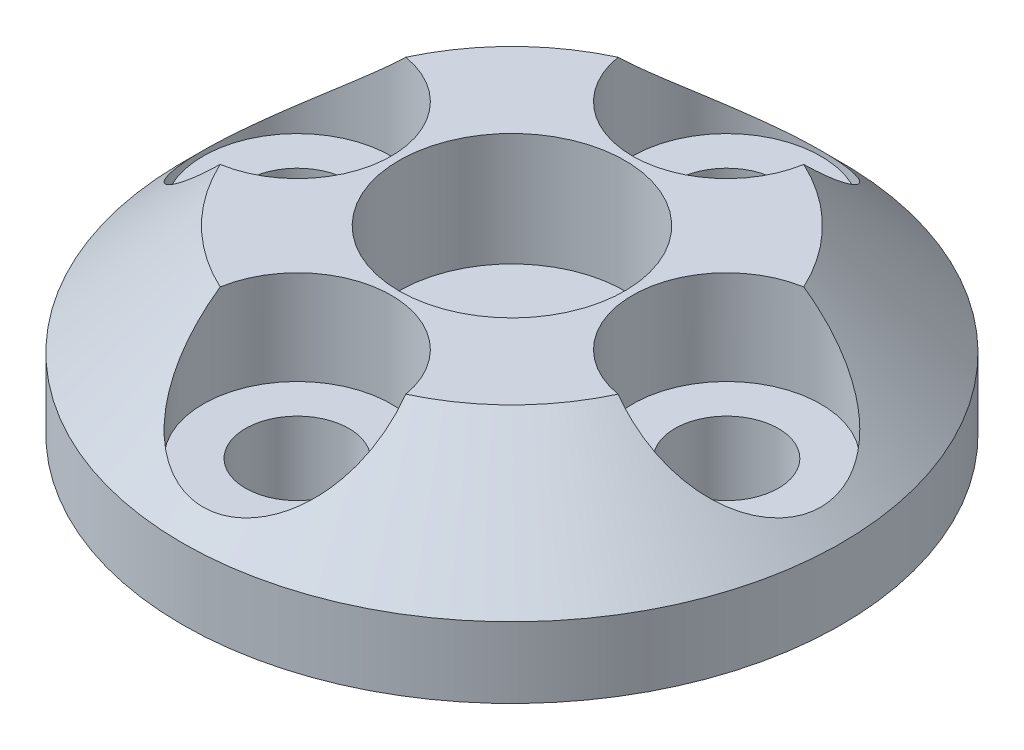
ISO-10303-21;
HEADER;
FILE_DESCRIPTION(('STEP AP214'),'2;1');
FILE_NAME('part.step','',(''),(''),'','','');
FILE_SCHEMA(('AUTOMOTIVE_DESIGN { 1 0 10303 214 1 1 1 1 }'));
ENDSEC;
DATA;
#1=APPLICATION_CONTEXT('core data for automotive mechanical design processes');
#2=APPLICATION_PROTOCOL_DEFINITION('international standard','automotive_design',2000,#1);
#3=PRODUCT_CONTEXT('',#1,'mechanical');
#4=PRODUCT('Part','Part','',(#3));
#5=PRODUCT_RELATED_PRODUCT_CATEGORY('part','',(#4));
#6=PRODUCT_DEFINITION_FORMATION('','',#4);
#7=PRODUCT_DEFINITION_CONTEXT('part definition',#1,'design');
#8=PRODUCT_DEFINITION('design','',#6,#7);
#9=PRODUCT_DEFINITION_SHAPE('','',#8);
#10=(LENGTH_UNIT() NAMED_UNIT(*) SI_UNIT(.MILLI.,.METRE.));
#11=(NAMED_UNIT(*) PLANE_ANGLE_UNIT() SI_UNIT($,.RADIAN.));
#12=(NAMED_UNIT(*) SI_UNIT($,.STERADIAN.) SOLID_ANGLE_UNIT());
#13=UNCERTAINTY_MEASURE_WITH_UNIT(LENGTH_MEASURE(1.E-05),#10,'distance_accuracy_value','');
#14=(GEOMETRIC_REPRESENTATION_CONTEXT(3) GLOBAL_UNCERTAINTY_ASSIGNED_CONTEXT((#13)) GLOBAL_UNIT_ASSIGNED_CONTEXT((#10,
#11,#12)) REPRESENTATION_CONTEXT('',''));
#15=CARTESIAN_POINT('',(0.,0.,0.));
#16=DIRECTION('',(0.,0.,1.));
#17=DIRECTION('',(1.,0.,0.));
#18=AXIS2_PLACEMENT_3D('',#15,#16,#17);
#19=CARTESIAN_POINT('',(0.,4.8,0.));
#20=DIRECTION('',(0.,-1.,0.));
#21=DIRECTION('',(0.,0.,-1.));
#22=AXIS2_PLACEMENT_3D('',#19,#20,#21);
#23=CYLINDRICAL_SURFACE('',#22,8.75);
#24=CARTESIAN_POINT('',(0.,1.87899999999998,0.));
#25=DIRECTION('',(0.,1.,0.));
#26=DIRECTION('',(0.,0.,1.));
#27=AXIS2_PLACEMENT_3D('',#24,#25,#26);
#28=CIRCLE('',#27,8.75);
#29=CARTESIAN_POINT('',(0.,1.87899999999998,8.75));
#30=VERTEX_POINT('',#29);
#31=EDGE_CURVE('E11',#30,#30,#28,.F.);
#32=ORIENTED_EDGE('',*,*,#31,.T.);
#33=EDGE_LOOP('',(#32));
#34=FACE_BOUND('',#33,.T.);
#35=CARTESIAN_POINT('',(0.,0.,0.));
#36=DIRECTION('',(0.,1.,0.));
#37=DIRECTION('',(0.,0.,1.));
#38=AXIS2_PLACEMENT_3D('',#35,#36,#37);
#39=CIRCLE('',#38,8.75);
#40=CARTESIAN_POINT('',(0.,0.,8.75));
#41=VERTEX_POINT('',#40);
#42=EDGE_CURVE('E115',#41,#41,#39,.T.);
#43=ORIENTED_EDGE('',*,*,#42,.T.);
#44=EDGE_LOOP('',(#43));
#45=FACE_BOUND('',#44,.T.);
#46=ADVANCED_FACE('F32',(#34,#45),#23,.T.);
#47=CARTESIAN_POINT('',(0.,4.8,0.));
#48=DIRECTION('',(0.,1.,0.));
#49=DIRECTION('',(0.,0.,1.));
#50=AXIS2_PLACEMENT_3D('',#47,#48,#49);
#51=PLANE('',#50);
#52=CARTESIAN_POINT('',(5.7,4.8,0.));
#53=DIRECTION('',(0.,1.,0.));
#54=DIRECTION('',(0.,0.,1.));
#55=AXIS2_PLACEMENT_3D('',#52,#53,#54);
#56=CIRCLE('',#55,2.5);
#57=CARTESIAN_POINT('',(5.28221412280697,4.8,-2.46484380049082));
#58=VERTEX_POINT('',#57);
#59=CARTESIAN_POINT('',(5.28221412280697,4.8,2.46484380049082));
#60=VERTEX_POINT('',#59);
#61=EDGE_CURVE('E86',#58,#60,#56,.T.);
#62=ORIENTED_EDGE('',*,*,#61,.F.);
#63=CARTESIAN_POINT('',(0.,4.8,0.));
#64=DIRECTION('',(0.,1.,0.));
#65=DIRECTION('',(0.,0.,1.));
#66=AXIS2_PLACEMENT_3D('',#63,#64,#65);
#67=CIRCLE('',#66,5.82899999999995);
#68=CARTESIAN_POINT('',(2.46484380049082,4.8,-5.28221412280697));
#69=VERTEX_POINT('',#68);
#70=EDGE_CURVE('E77',#58,#69,#67,.T.);
#71=ORIENTED_EDGE('',*,*,#70,.T.);
#72=CARTESIAN_POINT('',(0.,4.8,-5.7));
#73=DIRECTION('',(0.,1.,0.));
#74=DIRECTION('',(0.,0.,1.));
#75=AXIS2_PLACEMENT_3D('',#72,#73,#74);
#76=CIRCLE('',#75,2.5);
#77=CARTESIAN_POINT('',(-2.46484380049082,4.8,-5.28221412280697));
#78=VERTEX_POINT('',#77);
#79=EDGE_CURVE('E84',#78,#69,#76,.T.);
#80=ORIENTED_EDGE('',*,*,#79,.F.);
#81=CARTESIAN_POINT('',(0.,4.8,0.));
#82=DIRECTION('',(0.,1.,0.));
#83=DIRECTION('',(0.,0.,1.));
#84=AXIS2_PLACEMENT_3D('',#81,#82,#83);
#85=CIRCLE('',#84,5.82899999999995);
#86=CARTESIAN_POINT('',(-5.28221412280697,4.8,-2.46484380049082));
#87=VERTEX_POINT('',#86);
#88=EDGE_CURVE('E48',#78,#87,#85,.T.);
#89=ORIENTED_EDGE('',*,*,#88,.T.);
#90=CARTESIAN_POINT('',(-5.7,4.8,0.));
#91=DIRECTION('',(0.,1.,0.));
#92=DIRECTION('',(0.,0.,1.));
#93=AXIS2_PLACEMENT_3D('',#90,#91,#92);
#94=CIRCLE('',#93,2.5);
#95=CARTESIAN_POINT('',(-5.28221412280697,4.8,2.46484380049082));
#96=VERTEX_POINT('',#95);
#97=EDGE_CURVE('E93',#96,#87,#94,.T.);
#98=ORIENTED_EDGE('',*,*,#97,.F.);
#99=CARTESIAN_POINT('',(0.,4.8,0.));
#100=DIRECTION('',(0.,1.,0.));
#101=DIRECTION('',(0.,0.,1.));
#102=AXIS2_PLACEMENT_3D('',#99,#100,#101);
#103=CIRCLE('',#102,5.82899999999995);
#104=CARTESIAN_POINT('',(-2.46484380049082,4.8,5.28221412280697));
#105=VERTEX_POINT('',#104);
#106=EDGE_CURVE('E122',#96,#105,#103,.T.);
#107=ORIENTED_EDGE('',*,*,#106,.T.);
#108=CARTESIAN_POINT('',(0.,4.8,5.7));
#109=DIRECTION('',(0.,1.,0.));
#110=DIRECTION('',(0.,0.,1.));
#111=AXIS2_PLACEMENT_3D('',#108,#109,#110);
#112=CIRCLE('',#111,2.5);
#113=CARTESIAN_POINT('',(2.46484380049082,4.8,5.28221412280697));
#114=VERTEX_POINT('',#113);
#115=EDGE_CURVE('E103',#114,#105,#112,.T.);
#116=ORIENTED_EDGE('',*,*,#115,.F.);
#117=CARTESIAN_POINT('',(0.,4.8,0.));
#118=DIRECTION('',(0.,1.,0.));
#119=DIRECTION('',(0.,0.,1.));
#120=AXIS2_PLACEMENT_3D('',#117,#118,#119);
#121=CIRCLE('',#120,5.82899999999995);
#122=EDGE_CURVE('E120',#114,#60,#121,.T.);
#123=ORIENTED_EDGE('',*,*,#122,.T.);
#124=EDGE_LOOP('',(#62,#71,#80,#89,#98,#107,#116,#123));
#125=FACE_BOUND('',#124,.T.);
#126=CARTESIAN_POINT('',(0.,4.8,0.));
#127=DIRECTION('',(0.,1.,0.));
#128=DIRECTION('',(0.,0.,1.));
#129=AXIS2_PLACEMENT_3D('',#126,#127,#128);
#130=CIRCLE('',#129,3.);
#131=CARTESIAN_POINT('',(0.,4.8,3.));
#132=VERTEX_POINT('',#131);
#133=EDGE_CURVE('E110',#132,#132,#130,.T.);
#134=ORIENTED_EDGE('',*,*,#133,.F.);
#135=EDGE_LOOP('',(#134));
#136=FACE_BOUND('',#135,.T.);
#137=ADVANCED_FACE('F82',(#125,#136),#51,.T.);
#138=CARTESIAN_POINT('',(0.,0.,0.));
#139=DIRECTION('',(0.,1.,0.));
#140=DIRECTION('',(0.,0.,1.));
#141=AXIS2_PLACEMENT_3D('',#138,#139,#140);
#142=PLANE('',#141);
#143=CARTESIAN_POINT('',(0.,0.,-5.7));
#144=DIRECTION('',(0.,1.,0.));
#145=DIRECTION('',(0.,0.,1.));
#146=AXIS2_PLACEMENT_3D('',#143,#144,#145);
#147=CIRCLE('',#146,1.375);
#148=CARTESIAN_POINT('',(0.,0.,-4.325));
#149=VERTEX_POINT('',#148);
#150=EDGE_CURVE('E239',#149,#149,#147,.T.);
#151=ORIENTED_EDGE('',*,*,#150,.T.);
#152=EDGE_LOOP('',(#151));
#153=FACE_BOUND('',#152,.T.);
#154=CARTESIAN_POINT('',(5.7,0.,0.));
#155=DIRECTION('',(0.,1.,0.));
#156=DIRECTION('',(0.,0.,1.));
#157=AXIS2_PLACEMENT_3D('',#154,#155,#156);
#158=CIRCLE('',#157,1.375);
#159=CARTESIAN_POINT('',(5.7,0.,1.375));
#160=VERTEX_POINT('',#159);
#161=EDGE_CURVE('E236',#160,#160,#158,.T.);
#162=ORIENTED_EDGE('',*,*,#161,.T.);
#163=EDGE_LOOP('',(#162));
#164=FACE_BOUND('',#163,.T.);
#165=CARTESIAN_POINT('',(0.,0.,5.7));
#166=DIRECTION('',(0.,1.,0.));
#167=DIRECTION('',(0.,0.,1.));
#168=AXIS2_PLACEMENT_3D('',#165,#166,#167);
#169=CIRCLE('',#168,1.375);
#170=CARTESIAN_POINT('',(0.,0.,7.075));
#171=VERTEX_POINT('',#170);
#172=EDGE_CURVE('E231',#171,#171,#169,.T.);
#173=ORIENTED_EDGE('',*,*,#172,.T.);
#174=EDGE_LOOP('',(#173));
#175=FACE_BOUND('',#174,.T.);
#176=CARTESIAN_POINT('',(-5.7,0.,0.));
#177=DIRECTION('',(0.,1.,0.));
#178=DIRECTION('',(0.,0.,1.));
#179=AXIS2_PLACEMENT_3D('',#176,#177,#178);
#180=CIRCLE('',#179,1.375);
#181=CARTESIAN_POINT('',(-5.7,0.,1.375));
#182=VERTEX_POINT('',#181);
#183=EDGE_CURVE('E106',#182,#182,#180,.T.);
#184=ORIENTED_EDGE('',*,*,#183,.T.);
#185=EDGE_LOOP('',(#184));
#186=FACE_BOUND('',#185,.T.);
#187=ORIENTED_EDGE('',*,*,#42,.F.);
#188=EDGE_LOOP('',(#187));
#189=FACE_BOUND('',#188,.T.);
#190=ADVANCED_FACE('F183',(#153,#164,#175,#186,#189),#142,.F.);
#191=CARTESIAN_POINT('',(0.,1.8,0.));
#192=DIRECTION('',(0.,1.,0.));
#193=DIRECTION('',(0.,0.,1.));
#194=AXIS2_PLACEMENT_3D('',#191,#192,#193);
#195=CYLINDRICAL_SURFACE('',#194,3.);
#196=CARTESIAN_POINT('',(0.,1.8,0.));
#197=DIRECTION('',(0.,1.,0.));
#198=DIRECTION('',(0.,0.,1.));
#199=AXIS2_PLACEMENT_3D('',#196,#197,#198);
#200=CIRCLE('',#199,3.);
#201=CARTESIAN_POINT('',(0.,1.8,3.));
#202=VERTEX_POINT('',#201);
#203=EDGE_CURVE('E112',#202,#202,#200,.T.);
#204=ORIENTED_EDGE('',*,*,#203,.F.);
#205=EDGE_LOOP('',(#204));
#206=FACE_BOUND('',#205,.T.);
#207=ORIENTED_EDGE('',*,*,#133,.T.);
#208=EDGE_LOOP('',(#207));
#209=FACE_BOUND('',#208,.T.);
#210=ADVANCED_FACE('F179',(#206,#209),#195,.F.);
#211=CARTESIAN_POINT('',(0.,1.8,0.));
#212=DIRECTION('',(0.,1.,0.));
#213=DIRECTION('',(0.,0.,1.));
#214=AXIS2_PLACEMENT_3D('',#211,#212,#213);
#215=PLANE('',#214);
#216=ORIENTED_EDGE('',*,*,#203,.T.);
#217=EDGE_LOOP('',(#216));
#218=FACE_BOUND('',#217,.T.);
#219=ADVANCED_FACE('F175',(#218),#215,.T.);
#220=CARTESIAN_POINT('',(-5.7,2.3,0.));
#221=DIRECTION('',(0.,1.,0.));
#222=DIRECTION('',(0.,0.,1.));
#223=AXIS2_PLACEMENT_3D('',#220,#221,#222);
#224=CYLINDRICAL_SURFACE('',#223,2.5);
#225=CARTESIAN_POINT('',(-5.7,2.3,0.));
#226=DIRECTION('',(0.,1.,0.));
#227=DIRECTION('',(0.,0.,1.));
#228=AXIS2_PLACEMENT_3D('',#225,#226,#227);
#229=CIRCLE('',#228,2.5);
#230=CARTESIAN_POINT('',(-5.7,2.3,2.5));
#231=VERTEX_POINT('',#230);
#232=EDGE_CURVE('E107',#231,#231,#229,.T.);
#233=ORIENTED_EDGE('',*,*,#232,.F.);
#234=EDGE_LOOP('',(#233));
#235=FACE_BOUND('',#234,.T.);
#236=ORIENTED_EDGE('',*,*,#97,.T.);
#237=CARTESIAN_POINT('',(-5.28221412280697,4.8,-2.46484380049082));
#238=CARTESIAN_POINT('',(-5.35685185452661,4.72701175799832,-2.47748464183037));
#239=CARTESIAN_POINT('',(-5.4324437619375,4.65446725948549,-2.48681820358606));
#240=CARTESIAN_POINT('',(-5.585243304919,4.51042457385126,-2.49854405497803));
#241=CARTESIAN_POINT('',(-5.66245203180307,4.4389271526757,-2.50093149338337));
#242=CARTESIAN_POINT('',(-5.89686155100504,4.22552560489395,-2.49714852435835));
#243=CARTESIAN_POINT('',(-6.05591923761437,4.08561519336834,-2.47986859636929));
#244=CARTESIAN_POINT('',(-6.36178920286839,3.82458130082494,-2.41547889582656));
#245=CARTESIAN_POINT('',(-6.50858817243777,3.70284383442358,-2.37080290617975));
#246=CARTESIAN_POINT('',(-6.79743791636666,3.46908520453516,-2.25164936300002));
#247=CARTESIAN_POINT('',(-6.93950037027056,3.35703885570162,-2.17725206490176));
#248=CARTESIAN_POINT('',(-7.18633006950314,3.16633051840269,-2.01450799855736));
#249=CARTESIAN_POINT('',(-7.29298231840593,3.08541098190916,-1.93167609104576));
#250=CARTESIAN_POINT('',(-7.49522235712765,2.93411578133862,-1.74528857441806));
#251=CARTESIAN_POINT('',(-7.59081841471378,2.86373222675978,-1.64174861091044));
#252=CARTESIAN_POINT('',(-7.75216300730045,2.74626235026001,-1.43289140796958));
#253=CARTESIAN_POINT('',(-7.82024071447338,2.69725146100408,-1.33046232178874));
#254=CARTESIAN_POINT('',(-7.94200343174676,2.61022608575618,-1.11306505259367));
#255=CARTESIAN_POINT('',(-7.99569419442898,2.57220720415734,-0.998101907236316));
#256=CARTESIAN_POINT('',(-8.08594254680287,2.50860769345851,-0.757539813516246));
#257=CARTESIAN_POINT('',(-8.12240095105975,2.4830990394564,-0.631884090844494));
#258=CARTESIAN_POINT('',(-8.17528685432261,2.44617529257916,-0.37442311497189));
#259=CARTESIAN_POINT('',(-8.19172464747872,2.43475295679659,-0.242621058307452));
#260=CARTESIAN_POINT('',(-8.20282046725454,2.42703924251311,0.00874406262018123));
#261=CARTESIAN_POINT('',(-8.19953665510753,2.42931803419563,0.12817813387292));
#262=CARTESIAN_POINT('',(-8.1761268796412,2.44560751099777,0.364541250890062));
#263=CARTESIAN_POINT('',(-8.15600420242345,2.45961590708749,0.481470780849437));
#264=CARTESIAN_POINT('',(-8.1007170798256,2.49828453152934,0.706916776975113));
#265=CARTESIAN_POINT('',(-8.06590658256427,2.52269423732603,0.815564379543837));
#266=CARTESIAN_POINT('',(-7.98304535617101,2.58116993933686,1.02488281492334));
#267=CARTESIAN_POINT('',(-7.93499192413041,2.61523790686174,1.12555201391992));
#268=CARTESIAN_POINT('',(-7.8236233420379,2.69483320541779,1.32445672718976));
#269=CARTESIAN_POINT('',(-7.75942536768774,2.74103505855147,1.42192472247276));
#270=CARTESIAN_POINT('',(-7.62075389629209,2.84188640202683,1.60432263090368));
#271=CARTESIAN_POINT('',(-7.54627591744053,2.89653957817588,1.68924704177234));
#272=CARTESIAN_POINT('',(-7.37786886035834,3.02162427734208,1.85767759840974));
#273=CARTESIAN_POINT('',(-7.28269481985839,3.09319346194983,1.93908930084336));
#274=CARTESIAN_POINT('',(-7.08543661936823,3.24390184576992,2.08461493710995));
#275=CARTESIAN_POINT('',(-6.9833480298641,3.32304591117767,2.14871764903451));
#276=CARTESIAN_POINT('',(-6.72690489439696,3.52540275079093,2.28588432305007));
#277=CARTESIAN_POINT('',(-6.57017408245346,3.65209597539162,2.34942946883527));
#278=CARTESIAN_POINT('',(-6.25445646893793,3.91497356644743,2.44331798116976));
#279=CARTESIAN_POINT('',(-6.09546522118186,4.05117959691058,2.47358274855852));
#280=CARTESIAN_POINT('',(-5.82600335120247,4.28973502612568,2.49935868983763));
#281=CARTESIAN_POINT('',(-5.71476745854277,4.39051560745032,2.50237716303838));
#282=CARTESIAN_POINT('',(-5.49576917077739,4.59392603683369,2.49403198971323));
#283=CARTESIAN_POINT('',(-5.3879899662017,4.69654119979713,2.48275434609112));
#284=CARTESIAN_POINT('',(-5.28221412280697,4.8,2.46484380049082));
#285=B_SPLINE_CURVE_WITH_KNOTS('',3,(#237,#238,#239,#240,#241,#242,#243,#244,#245,#246,#247,
#248,#249,#250,#251,#252,#253,#254,#255,#256,#257,#258,#259,#260,#261,#262,#263,#264,#265,#266,
#267,#268,#269,#270,#271,#272,#273,#274,#275,#276,#277,#278,#279,#280,#281,#282,#283,#284),
.UNSPECIFIED.,.F.,.F.,(4,2,2,2,2,2,2,2,2,2,2,2,2,2,2,2,2,2,2,2,2,2,2,4),(0.,0.31534497175401,
0.630910130280914,1.26591913307851,1.85135987279008,2.43523033804621,2.90571205902747,
3.37583964956256,3.7713800599024,4.16676207765206,4.56439291403321,4.96181921110816,
5.31854310048601,5.67519739148945,6.02370800398157,6.37228980091359,6.74738530227407,
7.12264485479727,7.55378598779882,7.9852059742906,8.61574083578251,9.24776167116849,
9.69744843323235,10.1444427530248),.UNSPECIFIED.);
#286=EDGE_CURVE('E54',#87,#96,#285,.T.);
#287=ORIENTED_EDGE('',*,*,#286,.T.);
#288=EDGE_LOOP('',(#236,#287));
#289=FACE_BOUND('',#288,.T.);
#290=ADVANCED_FACE('F170',(#235,#289),#224,.F.);
#291=CARTESIAN_POINT('',(-5.7,2.3,0.));
#292=DIRECTION('',(0.,1.,0.));
#293=DIRECTION('',(0.,0.,1.));
#294=AXIS2_PLACEMENT_3D('',#291,#292,#293);
#295=PLANE('',#294);
#296=CARTESIAN_POINT('',(-5.7,2.3,0.));
#297=DIRECTION('',(0.,1.,0.));
#298=DIRECTION('',(0.,0.,1.));
#299=AXIS2_PLACEMENT_3D('',#296,#297,#298);
#300=CIRCLE('',#299,1.375);
#301=CARTESIAN_POINT('',(-5.7,2.3,1.375));
#302=VERTEX_POINT('',#301);
#303=EDGE_CURVE('E227',#302,#302,#300,.T.);
#304=ORIENTED_EDGE('',*,*,#303,.F.);
#305=EDGE_LOOP('',(#304));
#306=FACE_BOUND('',#305,.T.);
#307=ORIENTED_EDGE('',*,*,#232,.T.);
#308=EDGE_LOOP('',(#307));
#309=FACE_BOUND('',#308,.T.);
#310=ADVANCED_FACE('F167',(#306,#309),#295,.T.);
#311=CARTESIAN_POINT('',(0.,2.3,5.7));
#312=DIRECTION('',(0.,1.,0.));
#313=DIRECTION('',(0.,0.,1.));
#314=AXIS2_PLACEMENT_3D('',#311,#312,#313);
#315=CYLINDRICAL_SURFACE('',#314,2.5);
#316=CARTESIAN_POINT('',(0.,2.3,5.7));
#317=DIRECTION('',(0.,1.,0.));
#318=DIRECTION('',(0.,0.,1.));
#319=AXIS2_PLACEMENT_3D('',#316,#317,#318);
#320=CIRCLE('',#319,2.5);
#321=CARTESIAN_POINT('',(0.,2.3,8.2));
#322=VERTEX_POINT('',#321);
#323=EDGE_CURVE('E100',#322,#322,#320,.T.);
#324=ORIENTED_EDGE('',*,*,#323,.F.);
#325=EDGE_LOOP('',(#324));
#326=FACE_BOUND('',#325,.T.);
#327=ORIENTED_EDGE('',*,*,#115,.T.);
#328=CARTESIAN_POINT('',(-2.46484380049082,4.8,5.28221412280697));
#329=CARTESIAN_POINT('',(-2.47748464183037,4.72701175799832,5.35685185452661));
#330=CARTESIAN_POINT('',(-2.48681820358606,4.65446725948549,5.4324437619375));
#331=CARTESIAN_POINT('',(-2.49854405497803,4.51042457385126,5.585243304919));
#332=CARTESIAN_POINT('',(-2.50093149338337,4.4389271526757,5.66245203180307));
#333=CARTESIAN_POINT('',(-2.49714852435835,4.22552560489395,5.89686155100504));
#334=CARTESIAN_POINT('',(-2.47986859636929,4.08561519336834,6.05591923761437));
#335=CARTESIAN_POINT('',(-2.41547889582656,3.82458130082494,6.36178920286839));
#336=CARTESIAN_POINT('',(-2.37080290617975,3.70284383442358,6.50858817243778));
#337=CARTESIAN_POINT('',(-2.25164936300002,3.46908520453516,6.79743791636667));
#338=CARTESIAN_POINT('',(-2.17725206490176,3.35703885570162,6.93950037027056));
#339=CARTESIAN_POINT('',(-2.01450799855736,3.16633051840269,7.18633006950314));
#340=CARTESIAN_POINT('',(-1.93167609104576,3.08541098190916,7.29298231840593));
#341=CARTESIAN_POINT('',(-1.74528857441806,2.93411578133862,7.49522235712765));
#342=CARTESIAN_POINT('',(-1.64174861091044,2.86373222675977,7.59081841471378));
#343=CARTESIAN_POINT('',(-1.43289140796958,2.74626235026001,7.75216300730045));
#344=CARTESIAN_POINT('',(-1.33046232178874,2.69725146100408,7.82024071447338));
#345=CARTESIAN_POINT('',(-1.11306505259367,2.61022608575618,7.94200343174676));
#346=CARTESIAN_POINT('',(-0.998101907236315,2.57220720415734,7.99569419442898));
#347=CARTESIAN_POINT('',(-0.757539813516245,2.50860769345851,8.08594254680287));
#348=CARTESIAN_POINT('',(-0.631884090844493,2.4830990394564,8.12240095105975));
#349=CARTESIAN_POINT('',(-0.374423114971888,2.44617529257916,8.17528685432261));
#350=CARTESIAN_POINT('',(-0.24262105830745,2.43475295679659,8.19172464747872));
#351=CARTESIAN_POINT('',(0.00874406262018338,2.42703924251311,8.20282046725454));
#352=CARTESIAN_POINT('',(0.128178133872922,2.42931803419563,8.19953665510753));
#353=CARTESIAN_POINT('',(0.364541250890064,2.44560751099777,8.1761268796412));
#354=CARTESIAN_POINT('',(0.481470780849439,2.45961590708749,8.15600420242345));
#355=CARTESIAN_POINT('',(0.706916776975116,2.49828453152934,8.1007170798256));
#356=CARTESIAN_POINT('',(0.815564379543839,2.52269423732603,8.06590658256427));
#357=CARTESIAN_POINT('',(1.02488281492334,2.58116993933686,7.98304535617101));
#358=CARTESIAN_POINT('',(1.12555201391992,2.61523790686174,7.93499192413041));
#359=CARTESIAN_POINT('',(1.32445672718976,2.69483320541779,7.8236233420379));
#360=CARTESIAN_POINT('',(1.42192472247276,2.74103505855147,7.75942536768774));
#361=CARTESIAN_POINT('',(1.60432263090368,2.84188640202683,7.62075389629209));
#362=CARTESIAN_POINT('',(1.68924704177234,2.89653957817588,7.54627591744053));
#363=CARTESIAN_POINT('',(1.85767759840974,3.02162427734209,7.37786886035834));
#364=CARTESIAN_POINT('',(1.93908930084336,3.09319346194983,7.28269481985839));
#365=CARTESIAN_POINT('',(2.08461493710995,3.24390184576992,7.08543661936823));
#366=CARTESIAN_POINT('',(2.14871764903451,3.32304591117767,6.9833480298641));
#367=CARTESIAN_POINT('',(2.28588432305007,3.52540275079093,6.72690489439696));
#368=CARTESIAN_POINT('',(2.34942946883527,3.65209597539162,6.57017408245346));
#369=CARTESIAN_POINT('',(2.44331798116977,3.91497356644744,6.25445646893792));
#370=CARTESIAN_POINT('',(2.47358274855852,4.05117959691059,6.09546522118185));
#371=CARTESIAN_POINT('',(2.49935868983763,4.28973502612569,5.82600335120246));
#372=CARTESIAN_POINT('',(2.50237716303839,4.39051560745032,5.71476745854276));
#373=CARTESIAN_POINT('',(2.49403198971323,4.5939260368337,5.49576917077738));
#374=CARTESIAN_POINT('',(2.48275434609112,4.69654119979713,5.3879899662017));
#375=CARTESIAN_POINT('',(2.46484380049082,4.8,5.28221412280697));
#376=B_SPLINE_CURVE_WITH_KNOTS('',3,(#328,#329,#330,#331,#332,#333,#334,#335,#336,#337,#338,
#339,#340,#341,#342,#343,#344,#345,#346,#347,#348,#349,#350,#351,#352,#353,#354,#355,#356,#357,
#358,#359,#360,#361,#362,#363,#364,#365,#366,#367,#368,#369,#370,#371,#372,#373,#374,#375),
.UNSPECIFIED.,.F.,.F.,(4,2,2,2,2,2,2,2,2,2,2,2,2,2,2,2,2,2,2,2,2,2,2,4),(0.,0.31534497175401,
0.630910130280915,1.26591913307851,1.85135987279008,2.43523033804621,2.90571205902747,
3.37583964956256,3.77138005990241,4.16676207765206,4.56439291403321,4.96181921110816,
5.31854310048601,5.67519739148945,6.02370800398158,6.3722898009136,6.74738530227407,
7.12264485479727,7.55378598779883,7.98520597429061,8.61574083578252,9.2477616711685,
9.69744843323236,10.1444427530248),.UNSPECIFIED.);
#377=EDGE_CURVE('E158',#105,#114,#376,.T.);
#378=ORIENTED_EDGE('',*,*,#377,.T.);
#379=EDGE_LOOP('',(#327,#378));
#380=FACE_BOUND('',#379,.T.);
#381=ADVANCED_FACE('F163',(#326,#380),#315,.F.);
#382=CARTESIAN_POINT('',(0.,2.3,5.7));
#383=DIRECTION('',(0.,1.,0.));
#384=DIRECTION('',(0.,0.,1.));
#385=AXIS2_PLACEMENT_3D('',#382,#383,#384);
#386=PLANE('',#385);
#387=CARTESIAN_POINT('',(0.,2.3,5.7));
#388=DIRECTION('',(0.,1.,0.));
#389=DIRECTION('',(0.,0.,1.));
#390=AXIS2_PLACEMENT_3D('',#387,#388,#389);
#391=CIRCLE('',#390,1.375);
#392=CARTESIAN_POINT('',(0.,2.3,7.075));
#393=VERTEX_POINT('',#392);
#394=EDGE_CURVE('E243',#393,#393,#391,.T.);
#395=ORIENTED_EDGE('',*,*,#394,.F.);
#396=EDGE_LOOP('',(#395));
#397=FACE_BOUND('',#396,.T.);
#398=ORIENTED_EDGE('',*,*,#323,.T.);
#399=EDGE_LOOP('',(#398));
#400=FACE_BOUND('',#399,.T.);
#401=ADVANCED_FACE('F151',(#397,#400),#386,.T.);
#402=CARTESIAN_POINT('',(5.7,2.3,0.));
#403=DIRECTION('',(0.,1.,0.));
#404=DIRECTION('',(0.,0.,1.));
#405=AXIS2_PLACEMENT_3D('',#402,#403,#404);
#406=CYLINDRICAL_SURFACE('',#405,2.5);
#407=CARTESIAN_POINT('',(5.7,2.3,0.));
#408=DIRECTION('',(0.,1.,0.));
#409=DIRECTION('',(0.,0.,1.));
#410=AXIS2_PLACEMENT_3D('',#407,#408,#409);
#411=CIRCLE('',#410,2.5);
#412=CARTESIAN_POINT('',(5.7,2.3,2.5));
#413=VERTEX_POINT('',#412);
#414=EDGE_CURVE('E90',#413,#413,#411,.T.);
#415=ORIENTED_EDGE('',*,*,#414,.F.);
#416=EDGE_LOOP('',(#415));
#417=FACE_BOUND('',#416,.T.);
#418=ORIENTED_EDGE('',*,*,#61,.T.);
#419=CARTESIAN_POINT('',(5.28221412280697,4.8,2.46484380049082));
#420=CARTESIAN_POINT('',(5.35685185452661,4.72701175799832,2.47748464183037));
#421=CARTESIAN_POINT('',(5.4324437619375,4.65446725948549,2.48681820358606));
#422=CARTESIAN_POINT('',(5.585243304919,4.51042457385126,2.49854405497803));
#423=CARTESIAN_POINT('',(5.66245203180307,4.4389271526757,2.50093149338337));
#424=CARTESIAN_POINT('',(5.89686155100504,4.22552560489395,2.49714852435835));
#425=CARTESIAN_POINT('',(6.05591923761437,4.08561519336834,2.47986859636929));
#426=CARTESIAN_POINT('',(6.36178920286839,3.82458130082494,2.41547889582656));
#427=CARTESIAN_POINT('',(6.50858817243777,3.70284383442358,2.37080290617975));
#428=CARTESIAN_POINT('',(6.79743791636666,3.46908520453516,2.25164936300002));
#429=CARTESIAN_POINT('',(6.93950037027056,3.35703885570162,2.17725206490176));
#430=CARTESIAN_POINT('',(7.18633006950314,3.16633051840269,2.01450799855736));
#431=CARTESIAN_POINT('',(7.29298231840593,3.08541098190916,1.93167609104576));
#432=CARTESIAN_POINT('',(7.49522235712765,2.93411578133862,1.74528857441806));
#433=CARTESIAN_POINT('',(7.59081841471378,2.86373222675978,1.64174861091044));
#434=CARTESIAN_POINT('',(7.75216300730045,2.74626235026001,1.43289140796958));
#435=CARTESIAN_POINT('',(7.82024071447338,2.69725146100408,1.33046232178874));
#436=CARTESIAN_POINT('',(7.94200343174676,2.61022608575618,1.11306505259367));
#437=CARTESIAN_POINT('',(7.99569419442898,2.57220720415734,0.998101907236316));
#438=CARTESIAN_POINT('',(8.08594254680287,2.50860769345851,0.757539813516246));
#439=CARTESIAN_POINT('',(8.12240095105975,2.4830990394564,0.631884090844494));
#440=CARTESIAN_POINT('',(8.17528685432261,2.44617529257916,0.37442311497189));
#441=CARTESIAN_POINT('',(8.19172464747872,2.43475295679659,0.242621058307452));
#442=CARTESIAN_POINT('',(8.20282046725454,2.42703924251311,-0.00874406262018123));
#443=CARTESIAN_POINT('',(8.19953665510753,2.42931803419563,-0.12817813387292));
#444=CARTESIAN_POINT('',(8.1761268796412,2.44560751099777,-0.364541250890062));
#445=CARTESIAN_POINT('',(8.15600420242345,2.45961590708749,-0.481470780849437));
#446=CARTESIAN_POINT('',(8.1007170798256,2.49828453152934,-0.706916776975113));
#447=CARTESIAN_POINT('',(8.06590658256427,2.52269423732603,-0.815564379543837));
#448=CARTESIAN_POINT('',(7.98304535617101,2.58116993933686,-1.02488281492334));
#449=CARTESIAN_POINT('',(7.93499192413041,2.61523790686174,-1.12555201391992));
#450=CARTESIAN_POINT('',(7.8236233420379,2.69483320541779,-1.32445672718976));
#451=CARTESIAN_POINT('',(7.75942536768774,2.74103505855147,-1.42192472247276));
#452=CARTESIAN_POINT('',(7.62075389629209,2.84188640202683,-1.60432263090368));
#453=CARTESIAN_POINT('',(7.54627591744053,2.89653957817588,-1.68924704177234));
#454=CARTESIAN_POINT('',(7.37786886035834,3.02162427734208,-1.85767759840974));
#455=CARTESIAN_POINT('',(7.28269481985839,3.09319346194983,-1.93908930084336));
#456=CARTESIAN_POINT('',(7.08543661936823,3.24390184576992,-2.08461493710995));
#457=CARTESIAN_POINT('',(6.9833480298641,3.32304591117767,-2.14871764903451));
#458=CARTESIAN_POINT('',(6.72690489439696,3.52540275079093,-2.28588432305007));
#459=CARTESIAN_POINT('',(6.57017408245346,3.65209597539162,-2.34942946883527));
#460=CARTESIAN_POINT('',(6.25445646893793,3.91497356644743,-2.44331798116976));
#461=CARTESIAN_POINT('',(6.09546522118186,4.05117959691058,-2.47358274855852));
#462=CARTESIAN_POINT('',(5.82600335120247,4.28973502612568,-2.49935868983763));
#463=CARTESIAN_POINT('',(5.71476745854277,4.39051560745032,-2.50237716303838));
#464=CARTESIAN_POINT('',(5.49576917077739,4.59392603683369,-2.49403198971323));
#465=CARTESIAN_POINT('',(5.3879899662017,4.69654119979713,-2.48275434609112));
#466=CARTESIAN_POINT('',(5.28221412280697,4.8,-2.46484380049082));
#467=B_SPLINE_CURVE_WITH_KNOTS('',3,(#419,#420,#421,#422,#423,#424,#425,#426,#427,#428,#429,
#430,#431,#432,#433,#434,#435,#436,#437,#438,#439,#440,#441,#442,#443,#444,#445,#446,#447,#448,
#449,#450,#451,#452,#453,#454,#455,#456,#457,#458,#459,#460,#461,#462,#463,#464,#465,#466),
.UNSPECIFIED.,.F.,.F.,(4,2,2,2,2,2,2,2,2,2,2,2,2,2,2,2,2,2,2,2,2,2,2,4),(0.,0.31534497175401,
0.630910130280914,1.26591913307851,1.85135987279008,2.43523033804621,2.90571205902747,
3.37583964956256,3.7713800599024,4.16676207765206,4.56439291403321,4.96181921110816,
5.31854310048601,5.67519739148945,6.02370800398157,6.37228980091359,6.74738530227407,
7.12264485479727,7.55378598779882,7.9852059742906,8.61574083578251,9.24776167116849,
9.69744843323235,10.1444427530248),.UNSPECIFIED.);
#468=EDGE_CURVE('E41',#60,#58,#467,.T.);
#469=ORIENTED_EDGE('',*,*,#468,.T.);
#470=EDGE_LOOP('',(#418,#469));
#471=FACE_BOUND('',#470,.T.);
#472=ADVANCED_FACE('F146',(#417,#471),#406,.F.);
#473=CARTESIAN_POINT('',(5.7,2.3,0.));
#474=DIRECTION('',(0.,1.,0.));
#475=DIRECTION('',(0.,0.,1.));
#476=AXIS2_PLACEMENT_3D('',#473,#474,#475);
#477=PLANE('',#476);
#478=CARTESIAN_POINT('',(5.7,2.3,0.));
#479=DIRECTION('',(0.,1.,0.));
#480=DIRECTION('',(0.,0.,1.));
#481=AXIS2_PLACEMENT_3D('',#478,#479,#480);
#482=CIRCLE('',#481,1.375);
#483=CARTESIAN_POINT('',(5.7,2.3,1.375));
#484=VERTEX_POINT('',#483);
#485=EDGE_CURVE('E245',#484,#484,#482,.T.);
#486=ORIENTED_EDGE('',*,*,#485,.F.);
#487=EDGE_LOOP('',(#486));
#488=FACE_BOUND('',#487,.T.);
#489=ORIENTED_EDGE('',*,*,#414,.T.);
#490=EDGE_LOOP('',(#489));
#491=FACE_BOUND('',#490,.T.);
#492=ADVANCED_FACE('F141',(#488,#491),#477,.T.);
#493=CARTESIAN_POINT('',(0.,2.3,-5.7));
#494=DIRECTION('',(0.,1.,0.));
#495=DIRECTION('',(0.,0.,1.));
#496=AXIS2_PLACEMENT_3D('',#493,#494,#495);
#497=CYLINDRICAL_SURFACE('',#496,2.5);
#498=CARTESIAN_POINT('',(0.,2.3,-5.7));
#499=DIRECTION('',(0.,1.,0.));
#500=DIRECTION('',(0.,0.,1.));
#501=AXIS2_PLACEMENT_3D('',#498,#499,#500);
#502=CIRCLE('',#501,2.5);
#503=CARTESIAN_POINT('',(0.,2.3,-3.2));
#504=VERTEX_POINT('',#503);
#505=EDGE_CURVE('E89',#504,#504,#502,.T.);
#506=ORIENTED_EDGE('',*,*,#505,.F.);
#507=EDGE_LOOP('',(#506));
#508=FACE_BOUND('',#507,.T.);
#509=ORIENTED_EDGE('',*,*,#79,.T.);
#510=CARTESIAN_POINT('',(2.46484380049082,4.8,-5.28221412280697));
#511=CARTESIAN_POINT('',(2.47748464183037,4.72701175799832,-5.35685185452661));
#512=CARTESIAN_POINT('',(2.48681820358606,4.65446725948549,-5.4324437619375));
#513=CARTESIAN_POINT('',(2.49854405497803,4.51042457385126,-5.585243304919));
#514=CARTESIAN_POINT('',(2.50093149338337,4.4389271526757,-5.66245203180307));
#515=CARTESIAN_POINT('',(2.49714852435835,4.22552560489395,-5.89686155100504));
#516=CARTESIAN_POINT('',(2.47986859636929,4.08561519336834,-6.05591923761437));
#517=CARTESIAN_POINT('',(2.41547889582656,3.82458130082494,-6.36178920286839));
#518=CARTESIAN_POINT('',(2.37080290617975,3.70284383442358,-6.50858817243778));
#519=CARTESIAN_POINT('',(2.25164936300002,3.46908520453516,-6.79743791636667));
#520=CARTESIAN_POINT('',(2.17725206490176,3.35703885570162,-6.93950037027056));
#521=CARTESIAN_POINT('',(2.01450799855736,3.16633051840269,-7.18633006950314));
#522=CARTESIAN_POINT('',(1.93167609104576,3.08541098190916,-7.29298231840593));
#523=CARTESIAN_POINT('',(1.74528857441806,2.93411578133862,-7.49522235712765));
#524=CARTESIAN_POINT('',(1.64174861091044,2.86373222675977,-7.59081841471378));
#525=CARTESIAN_POINT('',(1.43289140796958,2.74626235026001,-7.75216300730045));
#526=CARTESIAN_POINT('',(1.33046232178874,2.69725146100408,-7.82024071447338));
#527=CARTESIAN_POINT('',(1.11306505259367,2.61022608575618,-7.94200343174676));
#528=CARTESIAN_POINT('',(0.998101907236315,2.57220720415734,-7.99569419442898));
#529=CARTESIAN_POINT('',(0.757539813516245,2.50860769345851,-8.08594254680287));
#530=CARTESIAN_POINT('',(0.631884090844493,2.4830990394564,-8.12240095105975));
#531=CARTESIAN_POINT('',(0.374423114971888,2.44617529257916,-8.17528685432261));
#532=CARTESIAN_POINT('',(0.24262105830745,2.43475295679659,-8.19172464747872));
#533=CARTESIAN_POINT('',(-0.00874406262018338,2.42703924251311,-8.20282046725454));
#534=CARTESIAN_POINT('',(-0.128178133872922,2.42931803419563,-8.19953665510753));
#535=CARTESIAN_POINT('',(-0.364541250890064,2.44560751099777,-8.1761268796412));
#536=CARTESIAN_POINT('',(-0.481470780849439,2.45961590708749,-8.15600420242345));
#537=CARTESIAN_POINT('',(-0.706916776975116,2.49828453152934,-8.1007170798256));
#538=CARTESIAN_POINT('',(-0.815564379543839,2.52269423732603,-8.06590658256427));
#539=CARTESIAN_POINT('',(-1.02488281492334,2.58116993933686,-7.98304535617101));
#540=CARTESIAN_POINT('',(-1.12555201391992,2.61523790686174,-7.93499192413041));
#541=CARTESIAN_POINT('',(-1.32445672718976,2.69483320541779,-7.8236233420379));
#542=CARTESIAN_POINT('',(-1.42192472247276,2.74103505855147,-7.75942536768774));
#543=CARTESIAN_POINT('',(-1.60432263090368,2.84188640202683,-7.62075389629209));
#544=CARTESIAN_POINT('',(-1.68924704177234,2.89653957817588,-7.54627591744053));
#545=CARTESIAN_POINT('',(-1.85767759840974,3.02162427734209,-7.37786886035834));
#546=CARTESIAN_POINT('',(-1.93908930084336,3.09319346194983,-7.28269481985839));
#547=CARTESIAN_POINT('',(-2.08461493710995,3.24390184576992,-7.08543661936823));
#548=CARTESIAN_POINT('',(-2.14871764903451,3.32304591117767,-6.9833480298641));
#549=CARTESIAN_POINT('',(-2.28588432305007,3.52540275079093,-6.72690489439696));
#550=CARTESIAN_POINT('',(-2.34942946883527,3.65209597539162,-6.57017408245346));
#551=CARTESIAN_POINT('',(-2.44331798116977,3.91497356644744,-6.25445646893792));
#552=CARTESIAN_POINT('',(-2.47358274855852,4.05117959691059,-6.09546522118185));
#553=CARTESIAN_POINT('',(-2.49935868983763,4.28973502612569,-5.82600335120246));
#554=CARTESIAN_POINT('',(-2.50237716303839,4.39051560745032,-5.71476745854276));
#555=CARTESIAN_POINT('',(-2.49403198971323,4.5939260368337,-5.49576917077738));
#556=CARTESIAN_POINT('',(-2.48275434609112,4.69654119979713,-5.3879899662017));
#557=CARTESIAN_POINT('',(-2.46484380049082,4.8,-5.28221412280697));
#558=B_SPLINE_CURVE_WITH_KNOTS('',3,(#510,#511,#512,#513,#514,#515,#516,#517,#518,#519,#520,
#521,#522,#523,#524,#525,#526,#527,#528,#529,#530,#531,#532,#533,#534,#535,#536,#537,#538,#539,
#540,#541,#542,#543,#544,#545,#546,#547,#548,#549,#550,#551,#552,#553,#554,#555,#556,#557),
.UNSPECIFIED.,.F.,.F.,(4,2,2,2,2,2,2,2,2,2,2,2,2,2,2,2,2,2,2,2,2,2,2,4),(0.,0.31534497175401,
0.630910130280915,1.26591913307851,1.85135987279008,2.43523033804621,2.90571205902747,
3.37583964956256,3.77138005990241,4.16676207765206,4.56439291403321,4.96181921110816,
5.31854310048601,5.67519739148945,6.02370800398158,6.3722898009136,6.74738530227407,
7.12264485479727,7.55378598779883,7.98520597429061,8.61574083578252,9.2477616711685,
9.69744843323236,10.1444427530248),.UNSPECIFIED.);
#559=EDGE_CURVE('E74',#69,#78,#558,.T.);
#560=ORIENTED_EDGE('',*,*,#559,.T.);
#561=EDGE_LOOP('',(#509,#560));
#562=FACE_BOUND('',#561,.T.);
#563=ADVANCED_FACE('F88',(#508,#562),#497,.F.);
#564=CARTESIAN_POINT('',(0.,2.3,-5.7));
#565=DIRECTION('',(0.,1.,0.));
#566=DIRECTION('',(0.,0.,1.));
#567=AXIS2_PLACEMENT_3D('',#564,#565,#566);
#568=PLANE('',#567);
#569=CARTESIAN_POINT('',(0.,2.3,-5.7));
#570=DIRECTION('',(0.,1.,0.));
#571=DIRECTION('',(0.,0.,1.));
#572=AXIS2_PLACEMENT_3D('',#569,#570,#571);
#573=CIRCLE('',#572,1.375);
#574=CARTESIAN_POINT('',(0.,2.3,-4.325));
#575=VERTEX_POINT('',#574);
#576=EDGE_CURVE('E242',#575,#575,#573,.T.);
#577=ORIENTED_EDGE('',*,*,#576,.F.);
#578=EDGE_LOOP('',(#577));
#579=FACE_BOUND('',#578,.T.);
#580=ORIENTED_EDGE('',*,*,#505,.T.);
#581=EDGE_LOOP('',(#580));
#582=FACE_BOUND('',#581,.T.);
#583=ADVANCED_FACE('F140',(#579,#582),#568,.T.);
#584=CARTESIAN_POINT('',(-5.7,-0.200000000000001,0.));
#585=DIRECTION('',(0.,1.,0.));
#586=DIRECTION('',(0.,0.,1.));
#587=AXIS2_PLACEMENT_3D('',#584,#585,#586);
#588=CYLINDRICAL_SURFACE('',#587,1.375);
#589=ORIENTED_EDGE('',*,*,#303,.T.);
#590=EDGE_LOOP('',(#589));
#591=FACE_BOUND('',#590,.T.);
#592=ORIENTED_EDGE('',*,*,#183,.F.);
#593=EDGE_LOOP('',(#592));
#594=FACE_BOUND('',#593,.T.);
#595=ADVANCED_FACE('F215',(#591,#594),#588,.F.);
#596=CARTESIAN_POINT('',(0.,-0.200000000000001,-5.7));
#597=DIRECTION('',(0.,1.,0.));
#598=DIRECTION('',(0.,0.,1.));
#599=AXIS2_PLACEMENT_3D('',#596,#597,#598);
#600=CYLINDRICAL_SURFACE('',#599,1.375);
#601=ORIENTED_EDGE('',*,*,#576,.T.);
#602=EDGE_LOOP('',(#601));
#603=FACE_BOUND('',#602,.T.);
#604=ORIENTED_EDGE('',*,*,#150,.F.);
#605=EDGE_LOOP('',(#604));
#606=FACE_BOUND('',#605,.T.);
#607=ADVANCED_FACE('F209',(#603,#606),#600,.F.);
#608=CARTESIAN_POINT('',(5.7,-0.200000000000001,0.));
#609=DIRECTION('',(0.,1.,0.));
#610=DIRECTION('',(0.,0.,1.));
#611=AXIS2_PLACEMENT_3D('',#608,#609,#610);
#612=CYLINDRICAL_SURFACE('',#611,1.375);
#613=ORIENTED_EDGE('',*,*,#485,.T.);
#614=EDGE_LOOP('',(#613));
#615=FACE_BOUND('',#614,.T.);
#616=ORIENTED_EDGE('',*,*,#161,.F.);
#617=EDGE_LOOP('',(#616));
#618=FACE_BOUND('',#617,.T.);
#619=ADVANCED_FACE('F203',(#615,#618),#612,.F.);
#620=CARTESIAN_POINT('',(0.,-0.200000000000001,5.7));
#621=DIRECTION('',(0.,1.,0.));
#622=DIRECTION('',(0.,0.,1.));
#623=AXIS2_PLACEMENT_3D('',#620,#621,#622);
#624=CYLINDRICAL_SURFACE('',#623,1.375);
#625=ORIENTED_EDGE('',*,*,#394,.T.);
#626=EDGE_LOOP('',(#625));
#627=FACE_BOUND('',#626,.T.);
#628=ORIENTED_EDGE('',*,*,#172,.F.);
#629=EDGE_LOOP('',(#628));
#630=FACE_BOUND('',#629,.T.);
#631=ADVANCED_FACE('F199',(#627,#630),#624,.F.);
#632=CARTESIAN_POINT('',(0.,4.8,0.));
#633=DIRECTION('',(0.,-1.,0.));
#634=DIRECTION('',(0.,0.,-1.));
#635=AXIS2_PLACEMENT_3D('',#632,#633,#634);
#636=CONICAL_SURFACE('',#635,5.82899999999995,0.785398163397453);
#637=ORIENTED_EDGE('',*,*,#31,.F.);
#638=EDGE_LOOP('',(#637));
#639=FACE_BOUND('',#638,.T.);
#640=ORIENTED_EDGE('',*,*,#559,.F.);
#641=ORIENTED_EDGE('',*,*,#70,.F.);
#642=ORIENTED_EDGE('',*,*,#468,.F.);
#643=ORIENTED_EDGE('',*,*,#122,.F.);
#644=ORIENTED_EDGE('',*,*,#377,.F.);
#645=ORIENTED_EDGE('',*,*,#106,.F.);
#646=ORIENTED_EDGE('',*,*,#286,.F.);
#647=ORIENTED_EDGE('',*,*,#88,.F.);
#648=EDGE_LOOP('',(#640,#641,#642,#643,#644,#645,#646,#647));
#649=FACE_BOUND('',#648,.T.);
#650=ADVANCED_FACE('F34',(#639,#649),#636,.T.);
#651=CLOSED_SHELL('',(#46,#137,#190,#210,#219,#290,#310,#381,#401,#472,#492,#563,#583,#595,#607,
#619,#631,#650));
#652=MANIFOLD_SOLID_BREP('B2',#651);
#653=ADVANCED_BREP_SHAPE_REPRESENTATION('',(#18,#652),#14);
#654=SHAPE_DEFINITION_REPRESENTATION(#9,#653);
ENDSEC;
END-ISO-10303-21;
